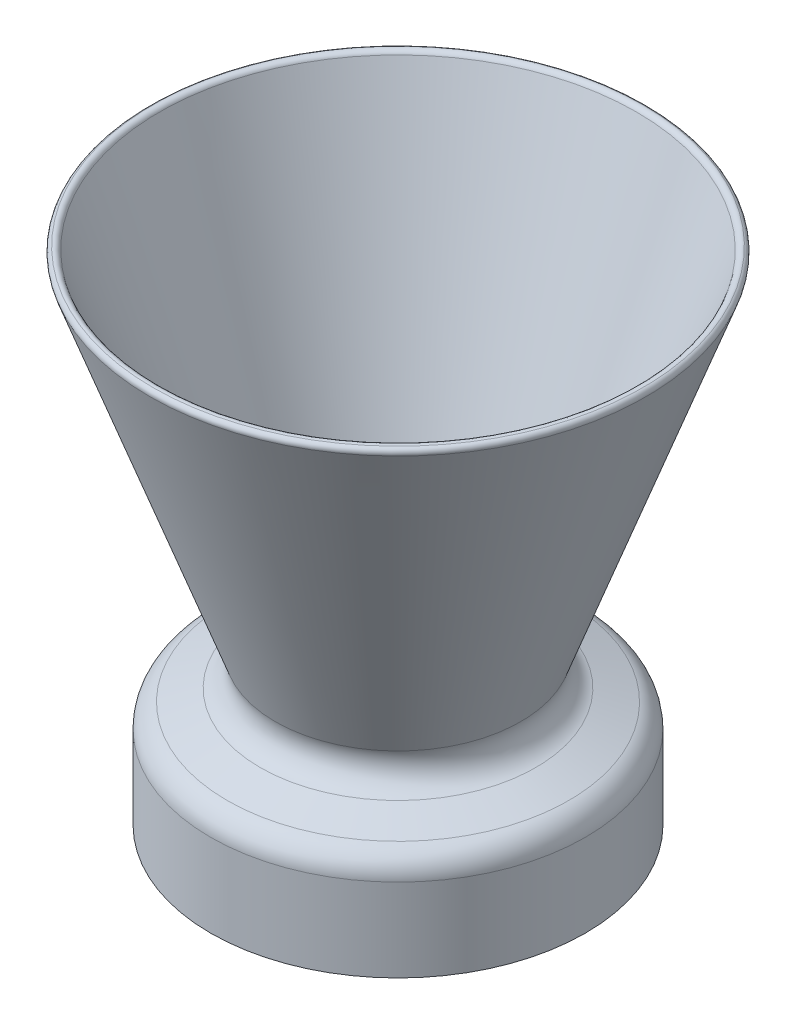
ISO-10303-21;
HEADER;
FILE_DESCRIPTION(('STEP AP214'),'2;1');
FILE_NAME('part.step','',(''),(''),'','','');
FILE_SCHEMA(('AUTOMOTIVE_DESIGN { 1 0 10303 214 1 1 1 1 }'));
ENDSEC;
DATA;
#1=APPLICATION_CONTEXT('core data for automotive mechanical design processes');
#2=APPLICATION_PROTOCOL_DEFINITION('international standard','automotive_design',2000,#1);
#3=PRODUCT_CONTEXT('',#1,'mechanical');
#4=PRODUCT('Part','Part','',(#3));
#5=PRODUCT_RELATED_PRODUCT_CATEGORY('part','',(#4));
#6=PRODUCT_DEFINITION_FORMATION('','',#4);
#7=PRODUCT_DEFINITION_CONTEXT('part definition',#1,'design');
#8=PRODUCT_DEFINITION('design','',#6,#7);
#9=PRODUCT_DEFINITION_SHAPE('','',#8);
#10=(LENGTH_UNIT() NAMED_UNIT(*) SI_UNIT(.MILLI.,.METRE.));
#11=(NAMED_UNIT(*) PLANE_ANGLE_UNIT() SI_UNIT($,.RADIAN.));
#12=(NAMED_UNIT(*) SI_UNIT($,.STERADIAN.) SOLID_ANGLE_UNIT());
#13=UNCERTAINTY_MEASURE_WITH_UNIT(LENGTH_MEASURE(1.E-05),#10,'distance_accuracy_value','');
#14=(GEOMETRIC_REPRESENTATION_CONTEXT(3) GLOBAL_UNCERTAINTY_ASSIGNED_CONTEXT((#13)) GLOBAL_UNIT_ASSIGNED_CONTEXT((#10,
#11,#12)) REPRESENTATION_CONTEXT('',''));
#15=CARTESIAN_POINT('',(0.,0.,0.));
#16=DIRECTION('',(0.,0.,1.));
#17=DIRECTION('',(1.,0.,0.));
#18=AXIS2_PLACEMENT_3D('',#15,#16,#17);
#19=CARTESIAN_POINT('',(-89.535,25.4,0.));
#20=DIRECTION('',(0.,1.,0.));
#21=DIRECTION('',(0.,0.,1.));
#22=AXIS2_PLACEMENT_3D('',#19,#20,#21);
#23=PLANE('',#22);
#24=CARTESIAN_POINT('',(0.,25.4,0.));
#25=DIRECTION('',(0.,1.,0.));
#26=DIRECTION('',(0.,0.,1.));
#27=AXIS2_PLACEMENT_3D('',#24,#25,#26);
#28=CIRCLE('',#27,48.9824878113749);
#29=CARTESIAN_POINT('',(0.,25.4,48.9824878113749));
#30=VERTEX_POINT('',#29);
#31=EDGE_CURVE('E51',#30,#30,#28,.T.);
#32=ORIENTED_EDGE('',*,*,#31,.T.);
#33=EDGE_LOOP('',(#32));
#34=FACE_BOUND('',#33,.T.);
#35=CARTESIAN_POINT('',(0.,25.4,0.));
#36=DIRECTION('',(0.,-1.,0.));
#37=DIRECTION('',(0.,0.,-1.));
#38=AXIS2_PLACEMENT_3D('',#35,#36,#37);
#39=CIRCLE('',#38,89.535);
#40=CARTESIAN_POINT('',(0.,25.4,-89.535));
#41=VERTEX_POINT('',#40);
#42=EDGE_CURVE('E85',#41,#41,#39,.T.);
#43=ORIENTED_EDGE('',*,*,#42,.T.);
#44=EDGE_LOOP('',(#43));
#45=FACE_BOUND('',#44,.T.);
#46=ADVANCED_FACE('F37',(#34,#45),#23,.F.);
#47=CARTESIAN_POINT('',(0.,25.4,0.));
#48=DIRECTION('',(0.,1.,0.));
#49=DIRECTION('',(0.,0.,1.));
#50=AXIS2_PLACEMENT_3D('',#47,#48,#49);
#51=CONICAL_SURFACE('',#50,38.1,0.349065850398867);
#52=CARTESIAN_POINT('',(0.,251.613180743204,0.));
#53=DIRECTION('',(0.,-1.,0.));
#54=DIRECTION('',(0.,0.,-1.));
#55=AXIS2_PLACEMENT_3D('',#52,#53,#54);
#56=CIRCLE('',#55,120.434864389207);
#57=CARTESIAN_POINT('',(0.,251.613180743204,-120.434864389207));
#58=VERTEX_POINT('',#57);
#59=EDGE_CURVE('E10',#58,#58,#56,.F.);
#60=ORIENTED_EDGE('',*,*,#59,.T.);
#61=EDGE_LOOP('',(#60));
#62=FACE_BOUND('',#61,.T.);
#63=CARTESIAN_POINT('',(0.,35.6261934921416,0.));
#64=DIRECTION('',(0.,-1.,0.));
#65=DIRECTION('',(0.,0.,-1.));
#66=AXIS2_PLACEMENT_3D('',#63,#64,#65);
#67=CIRCLE('',#66,41.8220300409863);
#68=CARTESIAN_POINT('',(0.,35.6261934921416,-41.8220300409863));
#69=VERTEX_POINT('',#68);
#70=EDGE_CURVE('E57',#69,#69,#67,.T.);
#71=ORIENTED_EDGE('',*,*,#70,.T.);
#72=EDGE_LOOP('',(#71));
#73=FACE_BOUND('',#72,.T.);
#74=ADVANCED_FACE('F108',(#62,#73),#51,.F.);
#75=CARTESIAN_POINT('',(0.,252.262537671906,0.));
#76=DIRECTION('',(0.,1.,0.));
#77=DIRECTION('',(0.,0.,1.));
#78=AXIS2_PLACEMENT_3D('',#75,#76,#77);
#79=CONICAL_SURFACE('',#78,126.077234066846,0.349065850398867);
#80=CARTESIAN_POINT('',(0.,249.875718415109,0.));
#81=DIRECTION('',(0.,-1.,0.));
#82=DIRECTION('',(0.,0.,-1.));
#83=AXIS2_PLACEMENT_3D('',#80,#81,#82);
#84=CIRCLE('',#83,125.208502902799);
#85=CARTESIAN_POINT('',(0.,249.875718415109,-125.208502902799));
#86=VERTEX_POINT('',#85);
#87=EDGE_CURVE('E46',#86,#86,#84,.T.);
#88=ORIENTED_EDGE('',*,*,#87,.T.);
#89=EDGE_LOOP('',(#88));
#90=FACE_BOUND('',#89,.T.);
#91=CARTESIAN_POINT('',(0.,76.1889692642149,0.));
#92=DIRECTION('',(0.,1.,0.));
#93=DIRECTION('',(0.,0.,1.));
#94=AXIS2_PLACEMENT_3D('',#91,#92,#93);
#95=CIRCLE('',#94,61.9916961254128);
#96=CARTESIAN_POINT('',(0.,76.1889692642149,61.9916961254128));
#97=VERTEX_POINT('',#96);
#98=EDGE_CURVE('E61',#97,#97,#95,.T.);
#99=ORIENTED_EDGE('',*,*,#98,.T.);
#100=EDGE_LOOP('',(#99));
#101=FACE_BOUND('',#100,.T.);
#102=ADVANCED_FACE('F114',(#90,#101),#79,.T.);
#103=CARTESIAN_POINT('',(0.,64.2548729802338,0.));
#104=DIRECTION('',(0.,-1.,0.));
#105=DIRECTION('',(0.,0.,-1.));
#106=AXIS2_PLACEMENT_3D('',#103,#104,#105);
#107=CONICAL_SURFACE('',#106,57.6480403051768,1.22173047639604);
#108=CARTESIAN_POINT('',(0.,53.8414605487177,0.));
#109=DIRECTION('',(0.,1.,0.));
#110=DIRECTION('',(0.,0.,1.));
#111=AXIS2_PLACEMENT_3D('',#108,#109,#110);
#112=CIRCLE('',#111,86.2586558202359);
#113=CARTESIAN_POINT('',(0.,53.8414605487177,86.2586558202359));
#114=VERTEX_POINT('',#113);
#115=EDGE_CURVE('E65',#114,#114,#112,.T.);
#116=ORIENTED_EDGE('',*,*,#115,.T.);
#117=EDGE_LOOP('',(#116));
#118=FACE_BOUND('',#117,.T.);
#119=CARTESIAN_POINT('',(0.,59.9112171599979,0.));
#120=DIRECTION('',(0.,-1.,0.));
#121=DIRECTION('',(0.,0.,-1.));
#122=AXIS2_PLACEMENT_3D('',#119,#120,#121);
#123=CIRCLE('',#122,69.5821365891579);
#124=CARTESIAN_POINT('',(0.,59.9112171599979,-69.5821365891579));
#125=VERTEX_POINT('',#124);
#126=EDGE_CURVE('E69',#125,#125,#123,.T.);
#127=ORIENTED_EDGE('',*,*,#126,.T.);
#128=EDGE_LOOP('',(#127));
#129=FACE_BOUND('',#128,.T.);
#130=ADVANCED_FACE('F131',(#118,#129),#107,.T.);
#131=CARTESIAN_POINT('',(0.,0.,0.));
#132=DIRECTION('',(0.,-1.,0.));
#133=DIRECTION('',(0.,0.,-1.));
#134=AXIS2_PLACEMENT_3D('',#131,#132,#133);
#135=CYLINDRICAL_SURFACE('',#134,94.615);
#136=CARTESIAN_POINT('',(0.,41.9073642647366,0.));
#137=DIRECTION('',(0.,1.,0.));
#138=DIRECTION('',(0.,0.,1.));
#139=AXIS2_PLACEMENT_3D('',#136,#137,#138);
#140=CIRCLE('',#139,94.615);
#141=CARTESIAN_POINT('',(0.,41.9073642647366,94.615));
#142=VERTEX_POINT('',#141);
#143=EDGE_CURVE('E73',#142,#142,#140,.F.);
#144=ORIENTED_EDGE('',*,*,#143,.T.);
#145=EDGE_LOOP('',(#144));
#146=FACE_BOUND('',#145,.T.);
#147=CARTESIAN_POINT('',(0.,0.,0.));
#148=DIRECTION('',(0.,-1.,0.));
#149=DIRECTION('',(0.,0.,-1.));
#150=AXIS2_PLACEMENT_3D('',#147,#148,#149);
#151=CIRCLE('',#150,94.615);
#152=CARTESIAN_POINT('',(0.,0.,-94.615));
#153=VERTEX_POINT('',#152);
#154=EDGE_CURVE('E77',#153,#153,#151,.T.);
#155=ORIENTED_EDGE('',*,*,#154,.F.);
#156=EDGE_LOOP('',(#155));
#157=FACE_BOUND('',#156,.T.);
#158=ADVANCED_FACE('F133',(#146,#157),#135,.T.);
#159=CARTESIAN_POINT('',(-89.535,0.,0.));
#160=DIRECTION('',(0.,1.,0.));
#161=DIRECTION('',(0.,0.,1.));
#162=AXIS2_PLACEMENT_3D('',#159,#160,#161);
#163=PLANE('',#162);
#164=CARTESIAN_POINT('',(0.,0.,0.));
#165=DIRECTION('',(0.,-1.,0.));
#166=DIRECTION('',(0.,0.,-1.));
#167=AXIS2_PLACEMENT_3D('',#164,#165,#166);
#168=CIRCLE('',#167,89.535);
#169=CARTESIAN_POINT('',(0.,0.,-89.535));
#170=VERTEX_POINT('',#169);
#171=EDGE_CURVE('E81',#170,#170,#168,.T.);
#172=ORIENTED_EDGE('',*,*,#171,.F.);
#173=EDGE_LOOP('',(#172));
#174=FACE_BOUND('',#173,.T.);
#175=ORIENTED_EDGE('',*,*,#154,.T.);
#176=EDGE_LOOP('',(#175));
#177=FACE_BOUND('',#176,.T.);
#178=ADVANCED_FACE('F140',(#174,#177),#163,.F.);
#179=CARTESIAN_POINT('',(0.,0.,0.));
#180=DIRECTION('',(0.,-1.,0.));
#181=DIRECTION('',(0.,0.,-1.));
#182=AXIS2_PLACEMENT_3D('',#179,#180,#181);
#183=CYLINDRICAL_SURFACE('',#182,89.535);
#184=ORIENTED_EDGE('',*,*,#42,.F.);
#185=EDGE_LOOP('',(#184));
#186=FACE_BOUND('',#185,.T.);
#187=ORIENTED_EDGE('',*,*,#171,.T.);
#188=EDGE_LOOP('',(#187));
#189=FACE_BOUND('',#188,.T.);
#190=ADVANCED_FACE('F121',(#186,#189),#183,.F.);
#191=CARTESIAN_POINT('',(0.,41.9073642647366,0.));
#192=DIRECTION('',(0.,1.,0.));
#193=DIRECTION('',(0.,0.,1.));
#194=AXIS2_PLACEMENT_3D('',#191,#192,#193);
#195=TOROIDAL_SURFACE('',#194,81.915,12.7);
#196=ORIENTED_EDGE('',*,*,#115,.F.);
#197=EDGE_LOOP('',(#196));
#198=FACE_BOUND('',#197,.T.);
#199=ORIENTED_EDGE('',*,*,#143,.F.);
#200=EDGE_LOOP('',(#199));
#201=FACE_BOUND('',#200,.T.);
#202=ADVANCED_FACE('F118',(#198,#201),#195,.T.);
#203=CARTESIAN_POINT('',(0.,71.8453134439789,0.));
#204=DIRECTION('',(0.,-1.,0.));
#205=DIRECTION('',(0.,0.,-1.));
#206=AXIS2_PLACEMENT_3D('',#203,#204,#205);
#207=TOROIDAL_SURFACE('',#206,73.9257924093939,12.7);
#208=ORIENTED_EDGE('',*,*,#98,.F.);
#209=EDGE_LOOP('',(#208));
#210=FACE_BOUND('',#209,.T.);
#211=ORIENTED_EDGE('',*,*,#126,.F.);
#212=EDGE_LOOP('',(#211));
#213=FACE_BOUND('',#212,.T.);
#214=ADVANCED_FACE('F104',(#210,#213),#207,.F.);
#215=CARTESIAN_POINT('',(0.,33.02,0.));
#216=DIRECTION('',(0.,1.,0.));
#217=DIRECTION('',(0.,0.,1.));
#218=AXIS2_PLACEMENT_3D('',#215,#216,#217);
#219=TOROIDAL_SURFACE('',#218,48.9824878113749,7.62);
#220=ORIENTED_EDGE('',*,*,#31,.F.);
#221=EDGE_LOOP('',(#220));
#222=FACE_BOUND('',#221,.T.);
#223=ORIENTED_EDGE('',*,*,#70,.F.);
#224=EDGE_LOOP('',(#223));
#225=FACE_BOUND('',#224,.T.);
#226=ADVANCED_FACE('F98',(#222,#225),#219,.T.);
#227=CARTESIAN_POINT('',(0.,250.744449579157,0.));
#228=DIRECTION('',(0.,1.,0.));
#229=DIRECTION('',(0.,0.,1.));
#230=AXIS2_PLACEMENT_3D('',#227,#228,#229);
#231=TOROIDAL_SURFACE('',#230,122.821683646003,2.54);
#232=ORIENTED_EDGE('',*,*,#59,.F.);
#233=EDGE_LOOP('',(#232));
#234=FACE_BOUND('',#233,.T.);
#235=CARTESIAN_POINT('',(0.,253.131268835953,0.));
#236=DIRECTION('',(0.,1.,0.));
#237=DIRECTION('',(0.,0.,1.));
#238=AXIS2_PLACEMENT_3D('',#235,#236,#237);
#239=CIRCLE('',#238,123.69041481005);
#240=CARTESIAN_POINT('',(0.,253.131268835953,123.69041481005));
#241=VERTEX_POINT('',#240);
#242=EDGE_CURVE('E41',#241,#241,#239,.F.);
#243=ORIENTED_EDGE('',*,*,#242,.F.);
#244=EDGE_LOOP('',(#243));
#245=FACE_BOUND('',#244,.T.);
#246=ADVANCED_FACE('F39',(#234,#245),#231,.T.);
#247=CARTESIAN_POINT('',(0.,250.744449579157,0.));
#248=DIRECTION('',(0.,1.,0.));
#249=DIRECTION('',(0.,0.,1.));
#250=AXIS2_PLACEMENT_3D('',#247,#248,#249);
#251=TOROIDAL_SURFACE('',#250,122.821683646003,2.54);
#252=ORIENTED_EDGE('',*,*,#242,.T.);
#253=EDGE_LOOP('',(#252));
#254=FACE_BOUND('',#253,.T.);
#255=ORIENTED_EDGE('',*,*,#87,.F.);
#256=EDGE_LOOP('',(#255));
#257=FACE_BOUND('',#256,.T.);
#258=ADVANCED_FACE('F94',(#254,#257),#251,.T.);
#259=CLOSED_SHELL('',(#46,#74,#102,#130,#158,#178,#190,#202,#214,#226,#246,#258));
#260=MANIFOLD_SOLID_BREP('B2',#259);
#261=ADVANCED_BREP_SHAPE_REPRESENTATION('',(#18,#260),#14);
#262=SHAPE_DEFINITION_REPRESENTATION(#9,#261);
ENDSEC;
END-ISO-10303-21;
